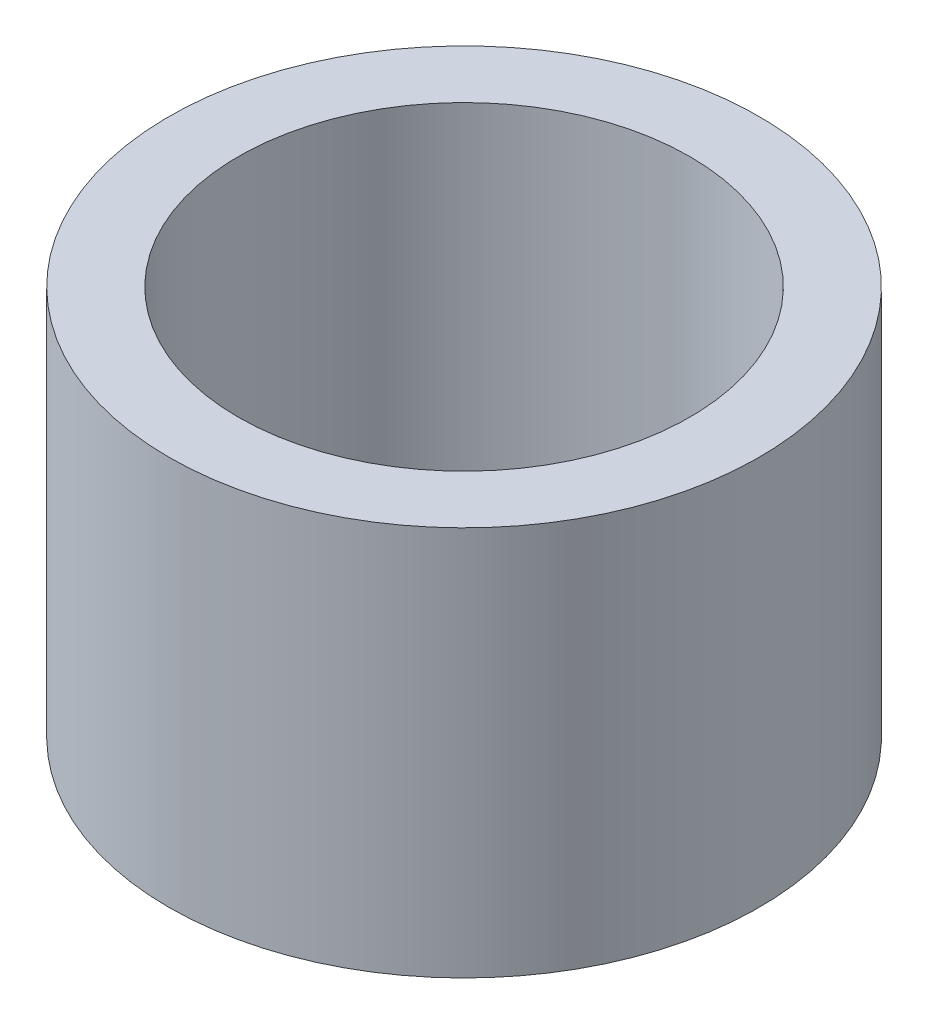
ISO-10303-21;
HEADER;
FILE_DESCRIPTION(('STEP AP214'),'2;1');
FILE_NAME('part.step','',(''),(''),'','','');
FILE_SCHEMA(('AUTOMOTIVE_DESIGN { 1 0 10303 214 1 1 1 1 }'));
ENDSEC;
DATA;
#1=APPLICATION_CONTEXT('core data for automotive mechanical design processes');
#2=APPLICATION_PROTOCOL_DEFINITION('international standard','automotive_design',2000,#1);
#3=PRODUCT_CONTEXT('',#1,'mechanical');
#4=PRODUCT('Part','Part','',(#3));
#5=PRODUCT_RELATED_PRODUCT_CATEGORY('part','',(#4));
#6=PRODUCT_DEFINITION_FORMATION('','',#4);
#7=PRODUCT_DEFINITION_CONTEXT('part definition',#1,'design');
#8=PRODUCT_DEFINITION('design','',#6,#7);
#9=PRODUCT_DEFINITION_SHAPE('','',#8);
#10=(LENGTH_UNIT() NAMED_UNIT(*) SI_UNIT(.MILLI.,.METRE.));
#11=(NAMED_UNIT(*) PLANE_ANGLE_UNIT() SI_UNIT($,.RADIAN.));
#12=(NAMED_UNIT(*) SI_UNIT($,.STERADIAN.) SOLID_ANGLE_UNIT());
#13=UNCERTAINTY_MEASURE_WITH_UNIT(LENGTH_MEASURE(1.E-05),#10,'distance_accuracy_value','');
#14=(GEOMETRIC_REPRESENTATION_CONTEXT(3) GLOBAL_UNCERTAINTY_ASSIGNED_CONTEXT((#13)) GLOBAL_UNIT_ASSIGNED_CONTEXT((#10,
#11,#12)) REPRESENTATION_CONTEXT('',''));
#15=CARTESIAN_POINT('',(0.,0.,0.));
#16=DIRECTION('',(0.,0.,1.));
#17=DIRECTION('',(1.,0.,0.));
#18=AXIS2_PLACEMENT_3D('',#15,#16,#17);
#19=CARTESIAN_POINT('',(0.,39.6312555132891,0.));
#20=DIRECTION('',(0.,-1.,0.));
#21=DIRECTION('',(0.,0.,-1.));
#22=AXIS2_PLACEMENT_3D('',#19,#20,#21);
#23=CYLINDRICAL_SURFACE('',#22,30.);
#24=CARTESIAN_POINT('',(0.,39.6312555132891,0.));
#25=DIRECTION('',(0.,1.,0.));
#26=DIRECTION('',(0.,0.,1.));
#27=AXIS2_PLACEMENT_3D('',#24,#25,#26);
#28=CIRCLE('',#27,30.);
#29=CARTESIAN_POINT('',(0.,39.6312555132891,30.));
#30=VERTEX_POINT('',#29);
#31=EDGE_CURVE('E10',#30,#30,#28,.T.);
#32=ORIENTED_EDGE('',*,*,#31,.F.);
#33=EDGE_LOOP('',(#32));
#34=FACE_BOUND('',#33,.T.);
#35=CARTESIAN_POINT('',(0.,0.,0.));
#36=DIRECTION('',(0.,1.,0.));
#37=DIRECTION('',(0.,0.,1.));
#38=AXIS2_PLACEMENT_3D('',#35,#36,#37);
#39=CIRCLE('',#38,30.);
#40=CARTESIAN_POINT('',(0.,0.,30.));
#41=VERTEX_POINT('',#40);
#42=EDGE_CURVE('E37',#41,#41,#39,.T.);
#43=ORIENTED_EDGE('',*,*,#42,.T.);
#44=EDGE_LOOP('',(#43));
#45=FACE_BOUND('',#44,.T.);
#46=ADVANCED_FACE('F40',(#34,#45),#23,.T.);
#47=CARTESIAN_POINT('',(0.,39.6312555132891,0.));
#48=DIRECTION('',(0.,1.,0.));
#49=DIRECTION('',(0.,0.,1.));
#50=AXIS2_PLACEMENT_3D('',#47,#48,#49);
#51=PLANE('',#50);
#52=CARTESIAN_POINT('',(0.,39.6312555132891,0.));
#53=DIRECTION('',(0.,1.,0.));
#54=DIRECTION('',(0.,0.,1.));
#55=AXIS2_PLACEMENT_3D('',#52,#53,#54);
#56=CIRCLE('',#55,22.9508821770775);
#57=CARTESIAN_POINT('',(0.,39.6312555132891,22.9508821770775));
#58=VERTEX_POINT('',#57);
#59=EDGE_CURVE('E50',#58,#58,#56,.T.);
#60=ORIENTED_EDGE('',*,*,#59,.F.);
#61=EDGE_LOOP('',(#60));
#62=FACE_BOUND('',#61,.T.);
#63=ORIENTED_EDGE('',*,*,#31,.T.);
#64=EDGE_LOOP('',(#63));
#65=FACE_BOUND('',#64,.T.);
#66=ADVANCED_FACE('F59',(#62,#65),#51,.T.);
#67=CARTESIAN_POINT('',(0.,0.,0.));
#68=DIRECTION('',(0.,1.,0.));
#69=DIRECTION('',(0.,0.,1.));
#70=AXIS2_PLACEMENT_3D('',#67,#68,#69);
#71=PLANE('',#70);
#72=CARTESIAN_POINT('',(0.,0.,0.));
#73=DIRECTION('',(0.,1.,0.));
#74=DIRECTION('',(0.,0.,1.));
#75=AXIS2_PLACEMENT_3D('',#72,#73,#74);
#76=CIRCLE('',#75,22.9508821770775);
#77=CARTESIAN_POINT('',(0.,0.,22.9508821770775));
#78=VERTEX_POINT('',#77);
#79=EDGE_CURVE('E47',#78,#78,#76,.T.);
#80=ORIENTED_EDGE('',*,*,#79,.T.);
#81=EDGE_LOOP('',(#80));
#82=FACE_BOUND('',#81,.T.);
#83=ORIENTED_EDGE('',*,*,#42,.F.);
#84=EDGE_LOOP('',(#83));
#85=FACE_BOUND('',#84,.T.);
#86=ADVANCED_FACE('F58',(#82,#85),#71,.F.);
#87=CARTESIAN_POINT('',(0.,39.6312555132891,0.));
#88=DIRECTION('',(0.,-1.,0.));
#89=DIRECTION('',(0.,0.,-1.));
#90=AXIS2_PLACEMENT_3D('',#87,#88,#89);
#91=CYLINDRICAL_SURFACE('',#90,22.9508821770775);
#92=ORIENTED_EDGE('',*,*,#59,.T.);
#93=EDGE_LOOP('',(#92));
#94=FACE_BOUND('',#93,.T.);
#95=ORIENTED_EDGE('',*,*,#79,.F.);
#96=EDGE_LOOP('',(#95));
#97=FACE_BOUND('',#96,.T.);
#98=ADVANCED_FACE('F54',(#94,#97),#91,.F.);
#99=CLOSED_SHELL('',(#46,#66,#86,#98));
#100=MANIFOLD_SOLID_BREP('B2',#99);
#101=ADVANCED_BREP_SHAPE_REPRESENTATION('',(#18,#100),#14);
#102=SHAPE_DEFINITION_REPRESENTATION(#9,#101);
ENDSEC;
END-ISO-10303-21;
